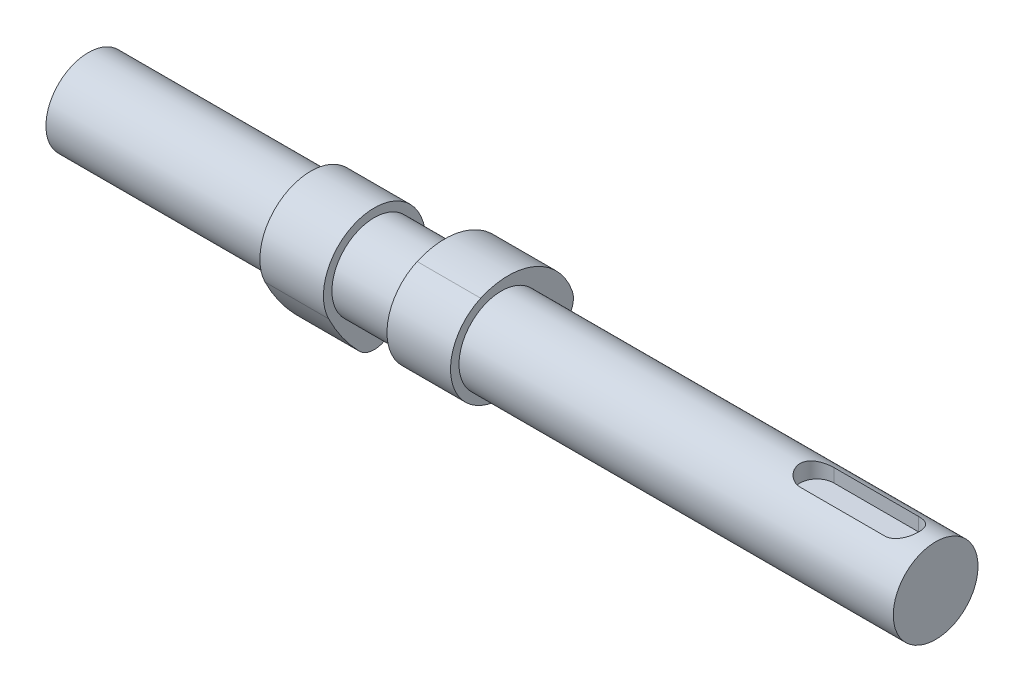
ISO-10303-21;
HEADER;
FILE_DESCRIPTION(('STEP AP214'),'2;1');
FILE_NAME('part.step','',(''),(''),'','','');
FILE_SCHEMA(('AUTOMOTIVE_DESIGN { 1 0 10303 214 1 1 1 1 }'));
ENDSEC;
DATA;
#1=APPLICATION_CONTEXT('core data for automotive mechanical design processes');
#2=APPLICATION_PROTOCOL_DEFINITION('international standard','automotive_design',2000,#1);
#3=PRODUCT_CONTEXT('',#1,'mechanical');
#4=PRODUCT('Part','Part','',(#3));
#5=PRODUCT_RELATED_PRODUCT_CATEGORY('part','',(#4));
#6=PRODUCT_DEFINITION_FORMATION('','',#4);
#7=PRODUCT_DEFINITION_CONTEXT('part definition',#1,'design');
#8=PRODUCT_DEFINITION('design','',#6,#7);
#9=PRODUCT_DEFINITION_SHAPE('','',#8);
#10=(LENGTH_UNIT() NAMED_UNIT(*) SI_UNIT(.MILLI.,.METRE.));
#11=(NAMED_UNIT(*) PLANE_ANGLE_UNIT() SI_UNIT($,.RADIAN.));
#12=(NAMED_UNIT(*) SI_UNIT($,.STERADIAN.) SOLID_ANGLE_UNIT());
#13=UNCERTAINTY_MEASURE_WITH_UNIT(LENGTH_MEASURE(1.E-05),#10,'distance_accuracy_value','');
#14=(GEOMETRIC_REPRESENTATION_CONTEXT(3) GLOBAL_UNCERTAINTY_ASSIGNED_CONTEXT((#13)) GLOBAL_UNIT_ASSIGNED_CONTEXT((#10,
#11,#12)) REPRESENTATION_CONTEXT('',''));
#15=CARTESIAN_POINT('',(0.,0.,0.));
#16=DIRECTION('',(0.,0.,1.));
#17=DIRECTION('',(1.,0.,0.));
#18=AXIS2_PLACEMENT_3D('',#15,#16,#17);
#19=CARTESIAN_POINT('',(-22.5,12.3749999999999,-25.1169141217627));
#20=DIRECTION('',(1.,0.,0.));
#21=DIRECTION('',(0.,1.,0.));
#22=AXIS2_PLACEMENT_3D('',#19,#20,#21);
#23=CYLINDRICAL_SURFACE('',#22,40.);
#24=CARTESIAN_POINT('',(-7.5,12.3749999999999,-25.1169141217627));
#25=DIRECTION('',(1.,0.,0.));
#26=DIRECTION('',(0.,-1.,0.));
#27=AXIS2_PLACEMENT_3D('',#24,#25,#26);
#28=CIRCLE('',#27,40.);
#29=CARTESIAN_POINT('',(-7.5,-5.30357142857138,10.7643917664697));
#30=VERTEX_POINT('',#29);
#31=CARTESIAN_POINT('',(-7.5,-15.4821428571428,3.58813058882329));
#32=VERTEX_POINT('',#31);
#33=EDGE_CURVE('E111',#30,#32,#28,.T.);
#34=ORIENTED_EDGE('',*,*,#33,.F.);
#35=DIRECTION('',(1.,0.,0.));
#36=VECTOR('',#35,1.);
#37=CARTESIAN_POINT('',(-22.5,-5.30357142857138,10.7643917664697));
#38=LINE('',#37,#36);
#39=CARTESIAN_POINT('',(-22.5,-5.30357142857138,10.7643917664697));
#40=VERTEX_POINT('',#39);
#41=EDGE_CURVE('E110',#40,#30,#38,.T.);
#42=ORIENTED_EDGE('',*,*,#41,.F.);
#43=CARTESIAN_POINT('',(-22.5,12.3749999999999,-25.1169141217627));
#44=DIRECTION('',(1.,0.,0.));
#45=DIRECTION('',(0.,-1.,0.));
#46=AXIS2_PLACEMENT_3D('',#43,#44,#45);
#47=CIRCLE('',#46,40.);
#48=CARTESIAN_POINT('',(-22.5,-15.4821428571428,3.58813058882329));
#49=VERTEX_POINT('',#48);
#50=EDGE_CURVE('E105',#40,#49,#47,.T.);
#51=ORIENTED_EDGE('',*,*,#50,.T.);
#52=DIRECTION('',(1.,0.,0.));
#53=VECTOR('',#52,1.);
#54=CARTESIAN_POINT('',(-22.5,-15.4821428571428,3.58813058882329));
#55=LINE('',#54,#53);
#56=EDGE_CURVE('E12',#49,#32,#55,.T.);
#57=ORIENTED_EDGE('',*,*,#56,.T.);
#58=EDGE_LOOP('',(#34,#42,#51,#57));
#59=FACE_BOUND('',#58,.T.);
#60=ADVANCED_FACE('F48',(#59),#23,.T.);
#61=CARTESIAN_POINT('',(-22.5,-12.,0.));
#62=DIRECTION('',(1.,0.,0.));
#63=DIRECTION('',(0.,1.,0.));
#64=AXIS2_PLACEMENT_3D('',#61,#62,#63);
#65=CYLINDRICAL_SURFACE('',#64,5.);
#66=CARTESIAN_POINT('',(-7.5,-12.,0.));
#67=DIRECTION('',(1.,0.,0.));
#68=DIRECTION('',(0.,-1.,0.));
#69=AXIS2_PLACEMENT_3D('',#66,#67,#68);
#70=CIRCLE('',#69,5.);
#71=CARTESIAN_POINT('',(-7.5,-16.7159090909091,-1.66138539968329));
#72=VERTEX_POINT('',#71);
#73=EDGE_CURVE('E113',#32,#72,#70,.T.);
#74=ORIENTED_EDGE('',*,*,#73,.F.);
#75=ORIENTED_EDGE('',*,*,#56,.F.);
#76=CARTESIAN_POINT('',(-22.5,-12.,0.));
#77=DIRECTION('',(1.,0.,0.));
#78=DIRECTION('',(0.,-1.,0.));
#79=AXIS2_PLACEMENT_3D('',#76,#77,#78);
#80=CIRCLE('',#79,5.);
#81=CARTESIAN_POINT('',(-22.5,-16.7159090909091,-1.66138539968329));
#82=VERTEX_POINT('',#81);
#83=EDGE_CURVE('E89',#49,#82,#80,.T.);
#84=ORIENTED_EDGE('',*,*,#83,.T.);
#85=DIRECTION('',(1.,0.,0.));
#86=VECTOR('',#85,1.);
#87=CARTESIAN_POINT('',(-22.5,-16.7159090909091,-1.66138539968329));
#88=LINE('',#87,#86);
#89=EDGE_CURVE('E56',#82,#72,#88,.T.);
#90=ORIENTED_EDGE('',*,*,#89,.T.);
#91=EDGE_LOOP('',(#74,#75,#84,#90));
#92=FACE_BOUND('',#91,.T.);
#93=ADVANCED_FACE('F103',(#92),#65,.T.);
#94=CARTESIAN_POINT('',(-22.5,-1.62499999999999,3.65504787930337));
#95=DIRECTION('',(1.,0.,0.));
#96=DIRECTION('',(0.,1.,0.));
#97=AXIS2_PLACEMENT_3D('',#94,#95,#96);
#98=CYLINDRICAL_SURFACE('',#97,16.);
#99=CARTESIAN_POINT('',(-7.5,-1.62499999999999,3.65504787930337));
#100=DIRECTION('',(1.,0.,0.));
#101=DIRECTION('',(0.,1.,0.));
#102=AXIS2_PLACEMENT_3D('',#99,#100,#101);
#103=CIRCLE('',#102,16.);
#104=CARTESIAN_POINT('',(-7.5,4.87499999999996,-10.9651436379101));
#105=VERTEX_POINT('',#104);
#106=EDGE_CURVE('E99',#72,#105,#103,.T.);
#107=ORIENTED_EDGE('',*,*,#106,.F.);
#108=ORIENTED_EDGE('',*,*,#89,.F.);
#109=CARTESIAN_POINT('',(-22.5,-1.62499999999999,3.65504787930337));
#110=DIRECTION('',(1.,0.,0.));
#111=DIRECTION('',(0.,1.,0.));
#112=AXIS2_PLACEMENT_3D('',#109,#110,#111);
#113=CIRCLE('',#112,16.);
#114=CARTESIAN_POINT('',(-22.5,4.87499999999996,-10.9651436379101));
#115=VERTEX_POINT('',#114);
#116=EDGE_CURVE('E92',#82,#115,#113,.T.);
#117=ORIENTED_EDGE('',*,*,#116,.T.);
#118=DIRECTION('',(1.,0.,0.));
#119=VECTOR('',#118,1.);
#120=CARTESIAN_POINT('',(-22.5,4.87499999999996,-10.9651436379101));
#121=LINE('',#120,#119);
#122=EDGE_CURVE('E102',#115,#105,#121,.T.);
#123=ORIENTED_EDGE('',*,*,#122,.T.);
#124=EDGE_LOOP('',(#107,#108,#117,#123));
#125=FACE_BOUND('',#124,.T.);
#126=ADVANCED_FACE('F98',(#125),#98,.T.);
#127=CARTESIAN_POINT('',(-22.5,0.,0.));
#128=DIRECTION('',(1.,0.,0.));
#129=DIRECTION('',(0.,1.,0.));
#130=AXIS2_PLACEMENT_3D('',#127,#128,#129);
#131=CYLINDRICAL_SURFACE('',#130,12.);
#132=CARTESIAN_POINT('',(-7.5,0.,0.));
#133=DIRECTION('',(1.,0.,0.));
#134=DIRECTION('',(0.,-1.,0.));
#135=AXIS2_PLACEMENT_3D('',#132,#133,#134);
#136=CIRCLE('',#135,12.);
#137=EDGE_CURVE('E78',#105,#30,#136,.T.);
#138=ORIENTED_EDGE('',*,*,#137,.F.);
#139=ORIENTED_EDGE('',*,*,#122,.F.);
#140=CARTESIAN_POINT('',(-22.5,0.,0.));
#141=DIRECTION('',(1.,0.,0.));
#142=DIRECTION('',(0.,-1.,0.));
#143=AXIS2_PLACEMENT_3D('',#140,#141,#142);
#144=CIRCLE('',#143,12.);
#145=EDGE_CURVE('E64',#115,#40,#144,.T.);
#146=ORIENTED_EDGE('',*,*,#145,.T.);
#147=ORIENTED_EDGE('',*,*,#41,.T.);
#148=EDGE_LOOP('',(#138,#139,#146,#147));
#149=FACE_BOUND('',#148,.T.);
#150=ADVANCED_FACE('F122',(#149),#131,.T.);
#151=CARTESIAN_POINT('',(-22.5,0.187499999999956,-12.5584570608813));
#152=DIRECTION('',(-1.,0.,0.));
#153=DIRECTION('',(0.,-1.,0.));
#154=AXIS2_PLACEMENT_3D('',#151,#152,#153);
#155=PLANE('',#154);
#156=ORIENTED_EDGE('',*,*,#50,.F.);
#157=ORIENTED_EDGE('',*,*,#145,.F.);
#158=ORIENTED_EDGE('',*,*,#116,.F.);
#159=ORIENTED_EDGE('',*,*,#83,.F.);
#160=EDGE_LOOP('',(#156,#157,#158,#159));
#161=FACE_BOUND('',#160,.T.);
#162=ADVANCED_FACE('F94',(#161),#155,.T.);
#163=CARTESIAN_POINT('',(-7.5,0.187499999999956,-12.5584570608813));
#164=DIRECTION('',(-1.,0.,0.));
#165=DIRECTION('',(0.,-1.,0.));
#166=AXIS2_PLACEMENT_3D('',#163,#164,#165);
#167=PLANE('',#166);
#168=ORIENTED_EDGE('',*,*,#33,.T.);
#169=ORIENTED_EDGE('',*,*,#73,.T.);
#170=ORIENTED_EDGE('',*,*,#106,.T.);
#171=ORIENTED_EDGE('',*,*,#137,.T.);
#172=EDGE_LOOP('',(#168,#169,#170,#171));
#173=FACE_BOUND('',#172,.T.);
#174=ADVANCED_FACE('F118',(#173),#167,.F.);
#175=CLOSED_SHELL('',(#60,#93,#126,#150,#162,#174));
#176=MANIFOLD_SOLID_BREP('B2',#175);
#177=CARTESIAN_POINT('',(22.5,25.1169141217626,12.375));
#178=DIRECTION('',(-1.,0.,0.));
#179=DIRECTION('',(0.,0.,1.));
#180=AXIS2_PLACEMENT_3D('',#177,#178,#179);
#181=CYLINDRICAL_SURFACE('',#180,40.);
#182=CARTESIAN_POINT('',(7.5,25.1169141217626,12.375));
#183=DIRECTION('',(1.,0.,0.));
#184=DIRECTION('',(0.,0.,-1.));
#185=AXIS2_PLACEMENT_3D('',#182,#183,#184);
#186=CIRCLE('',#185,40.);
#187=CARTESIAN_POINT('',(7.5,-10.7643917664697,-5.30357142857142));
#188=VERTEX_POINT('',#187);
#189=CARTESIAN_POINT('',(7.5,-3.58813058882324,-15.4821428571429));
#190=VERTEX_POINT('',#189);
#191=EDGE_CURVE('E256',#188,#190,#186,.T.);
#192=ORIENTED_EDGE('',*,*,#191,.T.);
#193=DIRECTION('',(-1.,0.,0.));
#194=VECTOR('',#193,1.);
#195=CARTESIAN_POINT('',(22.5,-3.58813058882324,-15.4821428571429));
#196=LINE('',#195,#194);
#197=CARTESIAN_POINT('',(22.5,-3.58813058882324,-15.4821428571429));
#198=VERTEX_POINT('',#197);
#199=EDGE_CURVE('E46',#198,#190,#196,.T.);
#200=ORIENTED_EDGE('',*,*,#199,.F.);
#201=CARTESIAN_POINT('',(22.5,25.1169141217626,12.375));
#202=DIRECTION('',(1.,0.,0.));
#203=DIRECTION('',(0.,0.,-1.));
#204=AXIS2_PLACEMENT_3D('',#201,#202,#203);
#205=CIRCLE('',#204,40.);
#206=CARTESIAN_POINT('',(22.5,-10.7643917664697,-5.30357142857142));
#207=VERTEX_POINT('',#206);
#208=EDGE_CURVE('E244',#207,#198,#205,.T.);
#209=ORIENTED_EDGE('',*,*,#208,.F.);
#210=DIRECTION('',(-1.,0.,0.));
#211=VECTOR('',#210,1.);
#212=CARTESIAN_POINT('',(22.5,-10.7643917664697,-5.30357142857142));
#213=LINE('',#212,#211);
#214=EDGE_CURVE('E252',#207,#188,#213,.T.);
#215=ORIENTED_EDGE('',*,*,#214,.T.);
#216=EDGE_LOOP('',(#192,#200,#209,#215));
#217=FACE_BOUND('',#216,.T.);
#218=ADVANCED_FACE('F193',(#217),#181,.T.);
#219=CARTESIAN_POINT('',(22.5,0.,-12.));
#220=DIRECTION('',(-1.,0.,0.));
#221=DIRECTION('',(0.,0.,1.));
#222=AXIS2_PLACEMENT_3D('',#219,#220,#221);
#223=CYLINDRICAL_SURFACE('',#222,5.);
#224=CARTESIAN_POINT('',(7.5,0.,-12.));
#225=DIRECTION('',(1.,0.,0.));
#226=DIRECTION('',(0.,0.,-1.));
#227=AXIS2_PLACEMENT_3D('',#224,#225,#226);
#228=CIRCLE('',#227,5.);
#229=CARTESIAN_POINT('',(7.5,1.66138539968335,-16.7159090909091));
#230=VERTEX_POINT('',#229);
#231=EDGE_CURVE('E248',#190,#230,#228,.T.);
#232=ORIENTED_EDGE('',*,*,#231,.T.);
#233=DIRECTION('',(-1.,0.,0.));
#234=VECTOR('',#233,1.);
#235=CARTESIAN_POINT('',(22.5,1.66138539968335,-16.7159090909091));
#236=LINE('',#235,#234);
#237=CARTESIAN_POINT('',(22.5,1.66138539968335,-16.7159090909091));
#238=VERTEX_POINT('',#237);
#239=EDGE_CURVE('E201',#238,#230,#236,.T.);
#240=ORIENTED_EDGE('',*,*,#239,.F.);
#241=CARTESIAN_POINT('',(22.5,0.,-12.));
#242=DIRECTION('',(1.,0.,0.));
#243=DIRECTION('',(0.,0.,-1.));
#244=AXIS2_PLACEMENT_3D('',#241,#242,#243);
#245=CIRCLE('',#244,5.);
#246=EDGE_CURVE('E239',#198,#238,#245,.T.);
#247=ORIENTED_EDGE('',*,*,#246,.F.);
#248=ORIENTED_EDGE('',*,*,#199,.T.);
#249=EDGE_LOOP('',(#232,#240,#247,#248));
#250=FACE_BOUND('',#249,.T.);
#251=ADVANCED_FACE('F247',(#250),#223,.T.);
#252=CARTESIAN_POINT('',(22.5,-3.65504787930336,-1.625));
#253=DIRECTION('',(-1.,0.,0.));
#254=DIRECTION('',(0.,0.,1.));
#255=AXIS2_PLACEMENT_3D('',#252,#253,#254);
#256=CYLINDRICAL_SURFACE('',#255,16.);
#257=CARTESIAN_POINT('',(7.5,-3.65504787930336,-1.625));
#258=DIRECTION('',(1.,0.,0.));
#259=DIRECTION('',(0.,0.,1.));
#260=AXIS2_PLACEMENT_3D('',#257,#258,#259);
#261=CIRCLE('',#260,16.);
#262=CARTESIAN_POINT('',(7.5,10.9651436379101,4.875));
#263=VERTEX_POINT('',#262);
#264=EDGE_CURVE('E226',#230,#263,#261,.T.);
#265=ORIENTED_EDGE('',*,*,#264,.T.);
#266=DIRECTION('',(-1.,0.,0.));
#267=VECTOR('',#266,1.);
#268=CARTESIAN_POINT('',(22.5,10.9651436379101,4.875));
#269=LINE('',#268,#267);
#270=CARTESIAN_POINT('',(22.5,10.9651436379101,4.875));
#271=VERTEX_POINT('',#270);
#272=EDGE_CURVE('E249',#271,#263,#269,.T.);
#273=ORIENTED_EDGE('',*,*,#272,.F.);
#274=CARTESIAN_POINT('',(22.5,-3.65504787930336,-1.625));
#275=DIRECTION('',(1.,0.,0.));
#276=DIRECTION('',(0.,0.,1.));
#277=AXIS2_PLACEMENT_3D('',#274,#275,#276);
#278=CIRCLE('',#277,16.);
#279=EDGE_CURVE('E242',#238,#271,#278,.T.);
#280=ORIENTED_EDGE('',*,*,#279,.F.);
#281=ORIENTED_EDGE('',*,*,#239,.T.);
#282=EDGE_LOOP('',(#265,#273,#280,#281));
#283=FACE_BOUND('',#282,.T.);
#284=ADVANCED_FACE('F250',(#283),#256,.T.);
#285=CARTESIAN_POINT('',(22.5,0.,0.));
#286=DIRECTION('',(-1.,0.,0.));
#287=DIRECTION('',(0.,0.,1.));
#288=AXIS2_PLACEMENT_3D('',#285,#286,#287);
#289=CYLINDRICAL_SURFACE('',#288,12.);
#290=CARTESIAN_POINT('',(7.5,0.,0.));
#291=DIRECTION('',(1.,0.,0.));
#292=DIRECTION('',(0.,0.,-1.));
#293=AXIS2_PLACEMENT_3D('',#290,#291,#292);
#294=CIRCLE('',#293,12.);
#295=EDGE_CURVE('E232',#263,#188,#294,.T.);
#296=ORIENTED_EDGE('',*,*,#295,.T.);
#297=ORIENTED_EDGE('',*,*,#214,.F.);
#298=CARTESIAN_POINT('',(22.5,0.,0.));
#299=DIRECTION('',(1.,0.,0.));
#300=DIRECTION('',(0.,0.,-1.));
#301=AXIS2_PLACEMENT_3D('',#298,#299,#300);
#302=CIRCLE('',#301,12.);
#303=EDGE_CURVE('E209',#271,#207,#302,.T.);
#304=ORIENTED_EDGE('',*,*,#303,.F.);
#305=ORIENTED_EDGE('',*,*,#272,.T.);
#306=EDGE_LOOP('',(#296,#297,#304,#305));
#307=FACE_BOUND('',#306,.T.);
#308=ADVANCED_FACE('F263',(#307),#289,.T.);
#309=CARTESIAN_POINT('',(22.5,12.5584570608813,0.1875));
#310=DIRECTION('',(1.,0.,0.));
#311=DIRECTION('',(0.,0.,-1.));
#312=AXIS2_PLACEMENT_3D('',#309,#310,#311);
#313=PLANE('',#312);
#314=ORIENTED_EDGE('',*,*,#208,.T.);
#315=ORIENTED_EDGE('',*,*,#246,.T.);
#316=ORIENTED_EDGE('',*,*,#279,.T.);
#317=ORIENTED_EDGE('',*,*,#303,.T.);
#318=EDGE_LOOP('',(#314,#315,#316,#317));
#319=FACE_BOUND('',#318,.T.);
#320=ADVANCED_FACE('F240',(#319),#313,.T.);
#321=CARTESIAN_POINT('',(7.5,12.5584570608813,0.1875));
#322=DIRECTION('',(1.,0.,0.));
#323=DIRECTION('',(0.,0.,-1.));
#324=AXIS2_PLACEMENT_3D('',#321,#322,#323);
#325=PLANE('',#324);
#326=ORIENTED_EDGE('',*,*,#191,.F.);
#327=ORIENTED_EDGE('',*,*,#295,.F.);
#328=ORIENTED_EDGE('',*,*,#264,.F.);
#329=ORIENTED_EDGE('',*,*,#231,.F.);
#330=EDGE_LOOP('',(#326,#327,#328,#329));
#331=FACE_BOUND('',#330,.T.);
#332=ADVANCED_FACE('F266',(#331),#325,.F.);
#333=CLOSED_SHELL('',(#218,#251,#284,#308,#320,#332));
#334=MANIFOLD_SOLID_BREP('B6',#333);
#335=CARTESIAN_POINT('',(125.,0.,0.));
#336=DIRECTION('',(-1.,0.,0.));
#337=DIRECTION('',(0.,0.,1.));
#338=AXIS2_PLACEMENT_3D('',#335,#336,#337);
#339=CYLINDRICAL_SURFACE('',#338,10.);
#340=DIRECTION('',(-1.,0.,0.));
#341=VECTOR('',#340,1.);
#342=CARTESIAN_POINT('',(125.,9.16515138991168,4.));
#343=LINE('',#342,#341);
#344=CARTESIAN_POINT('',(117.,9.16515138991168,4.));
#345=VERTEX_POINT('',#344);
#346=CARTESIAN_POINT('',(97.,9.16515138991168,4.));
#347=VERTEX_POINT('',#346);
#348=EDGE_CURVE('E191',#345,#347,#343,.T.);
#349=ORIENTED_EDGE('',*,*,#348,.T.);
#350=CARTESIAN_POINT('',(97.,9.16515138991168,4.));
#351=CARTESIAN_POINT('',(96.8923882949458,9.16512928809544,4.00001596071938));
#352=CARTESIAN_POINT('',(96.7847886688333,9.16704612011429,3.99565782731266));
#353=CARTESIAN_POINT('',(96.5704574034612,9.17459250745478,3.9783181194646));
#354=CARTESIAN_POINT('',(96.4637254492831,9.18022064873058,3.96533982937531));
#355=CARTESIAN_POINT('',(96.2523063568937,9.19499565865171,3.93095207352899));
#356=CARTESIAN_POINT('',(96.1476128319149,9.20412861441611,3.90957593640916));
#357=CARTESIAN_POINT('',(95.9405984565681,9.22560106586818,3.85863260381273));
#358=CARTESIAN_POINT('',(95.8382777514449,9.23794075728508,3.82906490834148));
#359=CARTESIAN_POINT('',(95.5361282988375,9.2791858250141,3.72853943587112));
#360=CARTESIAN_POINT('',(95.3406915386172,9.3123489831615,3.64568978920222));
#361=CARTESIAN_POINT('',(94.9664088398381,9.38624741529469,3.45096383184148));
#362=CARTESIAN_POINT('',(94.7875788940914,9.42698987727425,3.33905992673095));
#363=CARTESIAN_POINT('',(94.4414752066361,9.51401998804847,3.08263671474507));
#364=CARTESIAN_POINT('',(94.2752655660996,9.56048491272144,2.93673827988501));
#365=CARTESIAN_POINT('',(93.9689194556385,9.65225581096199,2.61939292349378));
#366=CARTESIAN_POINT('',(93.8287883384928,9.69756154495612,2.44794076987998));
#367=CARTESIAN_POINT('',(93.5731872113755,9.78406834216145,2.07601181629753));
#368=CARTESIAN_POINT('',(93.4589103805898,9.82503649102096,1.87465586655103));
#369=CARTESIAN_POINT('',(93.2663118555086,9.89607888234979,1.45364828604453));
#370=CARTESIAN_POINT('',(93.1879751552067,9.92615767032247,1.23400433637532));
#371=CARTESIAN_POINT('',(93.0733175942291,9.97076629361036,0.793934884187379));
#372=CARTESIAN_POINT('',(93.0351460866969,9.98597845290694,0.574062114869031));
#373=CARTESIAN_POINT('',(92.9959430515965,10.001606202074,0.130536855092214));
#374=CARTESIAN_POINT('',(92.9948983667482,10.0020270338048,-0.0931142682526694));
#375=CARTESIAN_POINT('',(93.0289656379282,9.98843920775428,-0.524466731987224));
#376=CARTESIAN_POINT('',(93.0620499465532,9.97523973659777,-0.732358330632746));
#377=CARTESIAN_POINT('',(93.1599870009102,9.93698538393897,-1.13934964738688));
#378=CARTESIAN_POINT('',(93.2248415445704,9.91192983148495,-1.33844886722558));
#379=CARTESIAN_POINT('',(93.3852720377719,9.85193670608706,-1.72579479688348));
#380=CARTESIAN_POINT('',(93.481296395839,9.81685584875391,-1.91383264586891));
#381=CARTESIAN_POINT('',(93.7009312637048,9.74029168639969,-2.2716159956307));
#382=CARTESIAN_POINT('',(93.8245514514378,9.69880613681324,-2.44135504792269));
#383=CARTESIAN_POINT('',(94.1052800574364,9.61043706268122,-2.7695225783069));
#384=CARTESIAN_POINT('',(94.2640530171164,9.56337795745419,-2.92647922614483));
#385=CARTESIAN_POINT('',(94.6059921366628,9.47123359153046,-3.2122147086262));
#386=CARTESIAN_POINT('',(94.7891693487996,9.42614923753061,-3.34098070594789));
#387=CARTESIAN_POINT('',(95.0816356456234,9.36326134539255,-3.51186134851388));
#388=CARTESIAN_POINT('',(95.1836718383149,9.34283170142195,-3.56571263251515));
#389=CARTESIAN_POINT('',(95.3923923024092,9.30450957703985,-3.66454761505659));
#390=CARTESIAN_POINT('',(95.4990745457273,9.28661600381593,-3.70953513634086));
#391=CARTESIAN_POINT('',(95.7162289304962,9.25400250539921,-3.79016254319007));
#392=CARTESIAN_POINT('',(95.8266961700413,9.23927864276951,-3.82581403809398));
#393=CARTESIAN_POINT('',(96.0506683681487,9.2135146773091,-3.88744848158463));
#394=CARTESIAN_POINT('',(96.1641719402125,9.20247292309662,-3.91343576505911));
#395=CARTESIAN_POINT('',(96.3974454473375,9.18417798205495,-3.95619393609845));
#396=CARTESIAN_POINT('',(96.5172941945638,9.17707470750587,-3.97260125584169));
#397=CARTESIAN_POINT('',(96.758090929137,9.16754485606458,-3.99451448409732));
#398=CARTESIAN_POINT('',(96.8790381929227,9.16511539745838,-4.0000271099601));
#399=CARTESIAN_POINT('',(97.,9.16515138991168,-4.));
#400=B_SPLINE_CURVE_WITH_KNOTS('',3,(#350,#351,#352,#353,#354,#355,#356,#357,#358,#359,#360,
#361,#362,#363,#364,#365,#366,#367,#368,#369,#370,#371,#372,#373,#374,#375,#376,#377,#378,#379,
#380,#381,#382,#383,#384,#385,#386,#387,#388,#389,#390,#391,#392,#393,#394,#395,#396,#397,#398,
#399),.UNSPECIFIED.,.F.,.F.,(4,2,2,2,2,2,2,2,2,2,2,2,2,2,2,2,2,2,2,2,2,2,2,2,4),(0.,
0.322709706217834,0.645296527806424,0.966615822543774,1.28795473422461,1.92936600351818,
2.5713886988925,3.24636095994996,3.92147161082383,4.62325717855527,5.32474946398645,
5.99227753012539,6.65956903033311,7.2893783052307,7.91922322615308,8.55856353859093,
9.19812842270037,9.87963749353246,10.5614562641081,10.9125878460839,11.2635676597187,
11.6141089352909,11.964492785171,12.3274303244848,12.6901440171997),.UNSPECIFIED.);
#401=CARTESIAN_POINT('',(97.,9.16515138991168,-4.));
#402=VERTEX_POINT('',#401);
#403=EDGE_CURVE('E404',#347,#402,#400,.T.);
#404=ORIENTED_EDGE('',*,*,#403,.T.);
#405=DIRECTION('',(-1.,0.,0.));
#406=VECTOR('',#405,1.);
#407=CARTESIAN_POINT('',(125.,9.16515138991168,-4.));
#408=LINE('',#407,#406);
#409=CARTESIAN_POINT('',(117.,9.16515138991168,-4.));
#410=VERTEX_POINT('',#409);
#411=EDGE_CURVE('E337',#402,#410,#408,.F.);
#412=ORIENTED_EDGE('',*,*,#411,.T.);
#413=CARTESIAN_POINT('',(117.,9.16515138991168,-4.));
#414=CARTESIAN_POINT('',(117.107611705054,9.16512928809544,-4.00001596071937));
#415=CARTESIAN_POINT('',(117.215211331167,9.16704612011429,-3.99565782731265));
#416=CARTESIAN_POINT('',(117.429542596539,9.17459250745478,-3.97831811946459));
#417=CARTESIAN_POINT('',(117.536274550717,9.18022064873058,-3.96533982937531));
#418=CARTESIAN_POINT('',(117.747693643106,9.19499565865171,-3.93095207352899));
#419=CARTESIAN_POINT('',(117.852387168085,9.20412861441611,-3.90957593640916));
#420=CARTESIAN_POINT('',(118.059401543432,9.22560106586818,-3.85863260381273));
#421=CARTESIAN_POINT('',(118.161722248555,9.23794075728508,-3.82906490834148));
#422=CARTESIAN_POINT('',(118.463871701162,9.2791858250141,-3.72853943587112));
#423=CARTESIAN_POINT('',(118.659308461383,9.3123489831615,-3.64568978920222));
#424=CARTESIAN_POINT('',(119.033591160162,9.38624741529469,-3.45096383184147));
#425=CARTESIAN_POINT('',(119.212421105909,9.42698987727425,-3.33905992673094));
#426=CARTESIAN_POINT('',(119.558524793364,9.51401998804847,-3.08263671474506));
#427=CARTESIAN_POINT('',(119.7247344339,9.56048491272144,-2.93673827988501));
#428=CARTESIAN_POINT('',(120.031080544362,9.65225581096199,-2.61939292349378));
#429=CARTESIAN_POINT('',(120.171211661507,9.69756154495612,-2.44794076987998));
#430=CARTESIAN_POINT('',(120.426812788624,9.78406834216145,-2.07601181629754));
#431=CARTESIAN_POINT('',(120.54108961941,9.82503649102096,-1.87465586655103));
#432=CARTESIAN_POINT('',(120.733688144491,9.89607888234979,-1.45364828604453));
#433=CARTESIAN_POINT('',(120.812024844793,9.92615767032247,-1.23400433637531));
#434=CARTESIAN_POINT('',(120.926682405771,9.97076629361036,-0.793934884187374));
#435=CARTESIAN_POINT('',(120.964853913303,9.98597845290694,-0.574062114869026));
#436=CARTESIAN_POINT('',(121.004056948403,10.001606202074,-0.130536855092209));
#437=CARTESIAN_POINT('',(121.005101633252,10.0020270338048,0.0931142682526744));
#438=CARTESIAN_POINT('',(120.971034362072,9.98843920775428,0.52446673198723));
#439=CARTESIAN_POINT('',(120.937950053447,9.97523973659777,0.732358330632752));
#440=CARTESIAN_POINT('',(120.84001299909,9.93698538393897,1.13934964738688));
#441=CARTESIAN_POINT('',(120.77515845543,9.91192983148495,1.33844886722558));
#442=CARTESIAN_POINT('',(120.614727962228,9.85193670608706,1.72579479688349));
#443=CARTESIAN_POINT('',(120.518703604161,9.81685584875391,1.91383264586892));
#444=CARTESIAN_POINT('',(120.299068736295,9.74029168639969,2.27161599563071));
#445=CARTESIAN_POINT('',(120.175448548562,9.69880613681324,2.4413550479227));
#446=CARTESIAN_POINT('',(119.894719942564,9.61043706268122,2.7695225783069));
#447=CARTESIAN_POINT('',(119.735946982884,9.56337795745419,2.92647922614483));
#448=CARTESIAN_POINT('',(119.394007863337,9.47123359153046,3.2122147086262));
#449=CARTESIAN_POINT('',(119.2108306512,9.42614923753061,3.34098070594789));
#450=CARTESIAN_POINT('',(118.918364354377,9.36326134539254,3.51186134851389));
#451=CARTESIAN_POINT('',(118.816328161685,9.34283170142194,3.56571263251515));
#452=CARTESIAN_POINT('',(118.607607697591,9.30450957703985,3.66454761505659));
#453=CARTESIAN_POINT('',(118.500925454273,9.28661600381593,3.70953513634086));
#454=CARTESIAN_POINT('',(118.283771069504,9.25400250539921,3.79016254319007));
#455=CARTESIAN_POINT('',(118.173303829959,9.23927864276951,3.82581403809398));
#456=CARTESIAN_POINT('',(117.949331631851,9.2135146773091,3.88744848158463));
#457=CARTESIAN_POINT('',(117.835828059787,9.20247292309662,3.91343576505912));
#458=CARTESIAN_POINT('',(117.602554552662,9.18417798205495,3.95619393609845));
#459=CARTESIAN_POINT('',(117.482705805436,9.17707470750587,3.9726012558417));
#460=CARTESIAN_POINT('',(117.241909070863,9.16754485606458,3.99451448409732));
#461=CARTESIAN_POINT('',(117.120961807077,9.16511539745838,4.0000271099601));
#462=CARTESIAN_POINT('',(117.,9.16515138991168,4.));
#463=B_SPLINE_CURVE_WITH_KNOTS('',3,(#413,#414,#415,#416,#417,#418,#419,#420,#421,#422,#423,
#424,#425,#426,#427,#428,#429,#430,#431,#432,#433,#434,#435,#436,#437,#438,#439,#440,#441,#442,
#443,#444,#445,#446,#447,#448,#449,#450,#451,#452,#453,#454,#455,#456,#457,#458,#459,#460,#461,
#462),.UNSPECIFIED.,.F.,.F.,(4,2,2,2,2,2,2,2,2,2,2,2,2,2,2,2,2,2,2,2,2,2,2,2,4),(0.,
0.322709706217834,0.645296527806424,0.966615822543774,1.28795473422461,1.92936600351818,
2.5713886988925,3.24636095994996,3.92147161082381,4.62325717855526,5.32474946398644,
5.99227753012539,6.65956903033311,7.2893783052307,7.91922322615308,8.55856353859093,
9.19812842270038,9.87963749353244,10.5614562641081,10.9125878460839,11.2635676597187,
11.6141089352909,11.964492785171,12.3274303244848,12.6901440171997),.UNSPECIFIED.);
#464=EDGE_CURVE('E344',#410,#345,#463,.T.);
#465=ORIENTED_EDGE('',*,*,#464,.T.);
#466=EDGE_LOOP('',(#349,#404,#412,#465));
#467=FACE_BOUND('',#466,.T.);
#468=CARTESIAN_POINT('',(125.,0.,0.));
#469=DIRECTION('',(1.,0.,0.));
#470=DIRECTION('',(0.,0.,-1.));
#471=AXIS2_PLACEMENT_3D('',#468,#469,#470);
#472=CIRCLE('',#471,10.);
#473=CARTESIAN_POINT('',(125.,0.,-10.));
#474=VERTEX_POINT('',#473);
#475=EDGE_CURVE('E401',#474,#474,#472,.T.);
#476=ORIENTED_EDGE('',*,*,#475,.F.);
#477=EDGE_LOOP('',(#476));
#478=FACE_BOUND('',#477,.T.);
#479=CARTESIAN_POINT('',(-75.,0.,0.));
#480=DIRECTION('',(1.,0.,0.));
#481=DIRECTION('',(0.,0.,-1.));
#482=AXIS2_PLACEMENT_3D('',#479,#480,#481);
#483=CIRCLE('',#482,10.);
#484=CARTESIAN_POINT('',(-75.,0.,-10.));
#485=VERTEX_POINT('',#484);
#486=EDGE_CURVE('E395',#485,#485,#483,.T.);
#487=ORIENTED_EDGE('',*,*,#486,.T.);
#488=EDGE_LOOP('',(#487));
#489=FACE_BOUND('',#488,.T.);
#490=ADVANCED_FACE('F329',(#467,#478,#489),#339,.T.);
#491=CARTESIAN_POINT('',(125.,0.,0.));
#492=DIRECTION('',(1.,0.,0.));
#493=DIRECTION('',(0.,0.,-1.));
#494=AXIS2_PLACEMENT_3D('',#491,#492,#493);
#495=PLANE('',#494);
#496=ORIENTED_EDGE('',*,*,#475,.T.);
#497=EDGE_LOOP('',(#496));
#498=FACE_BOUND('',#497,.T.);
#499=ADVANCED_FACE('F431',(#498),#495,.T.);
#500=CARTESIAN_POINT('',(-75.,0.,0.));
#501=DIRECTION('',(1.,0.,0.));
#502=DIRECTION('',(0.,0.,-1.));
#503=AXIS2_PLACEMENT_3D('',#500,#501,#502);
#504=PLANE('',#503);
#505=ORIENTED_EDGE('',*,*,#486,.F.);
#506=EDGE_LOOP('',(#505));
#507=FACE_BOUND('',#506,.T.);
#508=ADVANCED_FACE('F429',(#507),#504,.F.);
#509=CARTESIAN_POINT('',(117.,6.,0.));
#510=DIRECTION('',(0.,1.,0.));
#511=DIRECTION('',(0.,0.,1.));
#512=AXIS2_PLACEMENT_3D('',#509,#510,#511);
#513=CYLINDRICAL_SURFACE('',#512,4.);
#514=DIRECTION('',(0.,1.,0.));
#515=VECTOR('',#514,1.);
#516=CARTESIAN_POINT('',(117.,6.,-4.));
#517=LINE('',#516,#515);
#518=CARTESIAN_POINT('',(117.,6.,-4.));
#519=VERTEX_POINT('',#518);
#520=EDGE_CURVE('E367',#519,#410,#517,.T.);
#521=ORIENTED_EDGE('',*,*,#520,.F.);
#522=CARTESIAN_POINT('',(117.,6.,0.));
#523=DIRECTION('',(0.,1.,0.));
#524=DIRECTION('',(0.,0.,1.));
#525=AXIS2_PLACEMENT_3D('',#522,#523,#524);
#526=CIRCLE('',#525,4.);
#527=CARTESIAN_POINT('',(117.,6.,4.));
#528=VERTEX_POINT('',#527);
#529=EDGE_CURVE('E371',#528,#519,#526,.T.);
#530=ORIENTED_EDGE('',*,*,#529,.F.);
#531=DIRECTION('',(0.,1.,0.));
#532=VECTOR('',#531,1.);
#533=CARTESIAN_POINT('',(117.,6.,4.));
#534=LINE('',#533,#532);
#535=EDGE_CURVE('E393',#528,#345,#534,.T.);
#536=ORIENTED_EDGE('',*,*,#535,.T.);
#537=ORIENTED_EDGE('',*,*,#464,.F.);
#538=EDGE_LOOP('',(#521,#530,#536,#537));
#539=FACE_BOUND('',#538,.T.);
#540=ADVANCED_FACE('F369',(#539),#513,.F.);
#541=CARTESIAN_POINT('',(117.,6.,4.));
#542=DIRECTION('',(0.,0.,1.));
#543=DIRECTION('',(1.,0.,0.));
#544=AXIS2_PLACEMENT_3D('',#541,#542,#543);
#545=PLANE('',#544);
#546=ORIENTED_EDGE('',*,*,#535,.F.);
#547=DIRECTION('',(1.,0.,0.));
#548=VECTOR('',#547,1.);
#549=CARTESIAN_POINT('',(117.,6.,4.));
#550=LINE('',#549,#548);
#551=CARTESIAN_POINT('',(97.,6.,4.));
#552=VERTEX_POINT('',#551);
#553=EDGE_CURVE('E376',#552,#528,#550,.T.);
#554=ORIENTED_EDGE('',*,*,#553,.F.);
#555=DIRECTION('',(0.,1.,0.));
#556=VECTOR('',#555,1.);
#557=CARTESIAN_POINT('',(97.,6.,4.));
#558=LINE('',#557,#556);
#559=EDGE_CURVE('E396',#552,#347,#558,.T.);
#560=ORIENTED_EDGE('',*,*,#559,.T.);
#561=ORIENTED_EDGE('',*,*,#348,.F.);
#562=EDGE_LOOP('',(#546,#554,#560,#561));
#563=FACE_BOUND('',#562,.T.);
#564=ADVANCED_FACE('F422',(#563),#545,.F.);
#565=CARTESIAN_POINT('',(97.,6.,0.));
#566=DIRECTION('',(0.,1.,0.));
#567=DIRECTION('',(0.,0.,1.));
#568=AXIS2_PLACEMENT_3D('',#565,#566,#567);
#569=CYLINDRICAL_SURFACE('',#568,4.);
#570=ORIENTED_EDGE('',*,*,#559,.F.);
#571=CARTESIAN_POINT('',(97.,6.,0.));
#572=DIRECTION('',(0.,1.,0.));
#573=DIRECTION('',(0.,0.,1.));
#574=AXIS2_PLACEMENT_3D('',#571,#572,#573);
#575=CIRCLE('',#574,4.);
#576=CARTESIAN_POINT('',(97.,6.,-4.));
#577=VERTEX_POINT('',#576);
#578=EDGE_CURVE('E385',#577,#552,#575,.T.);
#579=ORIENTED_EDGE('',*,*,#578,.F.);
#580=DIRECTION('',(0.,1.,0.));
#581=VECTOR('',#580,1.);
#582=CARTESIAN_POINT('',(97.,6.,-4.));
#583=LINE('',#582,#581);
#584=EDGE_CURVE('E375',#577,#402,#583,.T.);
#585=ORIENTED_EDGE('',*,*,#584,.T.);
#586=ORIENTED_EDGE('',*,*,#403,.F.);
#587=EDGE_LOOP('',(#570,#579,#585,#586));
#588=FACE_BOUND('',#587,.T.);
#589=ADVANCED_FACE('F417',(#588),#569,.F.);
#590=CARTESIAN_POINT('',(117.,6.,-4.));
#591=DIRECTION('',(0.,0.,-1.));
#592=DIRECTION('',(-1.,0.,0.));
#593=AXIS2_PLACEMENT_3D('',#590,#591,#592);
#594=PLANE('',#593);
#595=ORIENTED_EDGE('',*,*,#584,.F.);
#596=DIRECTION('',(-1.,0.,0.));
#597=VECTOR('',#596,1.);
#598=CARTESIAN_POINT('',(117.,6.,-4.));
#599=LINE('',#598,#597);
#600=EDGE_CURVE('E379',#519,#577,#599,.T.);
#601=ORIENTED_EDGE('',*,*,#600,.F.);
#602=ORIENTED_EDGE('',*,*,#520,.T.);
#603=ORIENTED_EDGE('',*,*,#411,.F.);
#604=EDGE_LOOP('',(#595,#601,#602,#603));
#605=FACE_BOUND('',#604,.T.);
#606=ADVANCED_FACE('F380',(#605),#594,.F.);
#607=CARTESIAN_POINT('',(117.,6.,0.));
#608=DIRECTION('',(0.,1.,0.));
#609=DIRECTION('',(0.,0.,1.));
#610=AXIS2_PLACEMENT_3D('',#607,#608,#609);
#611=PLANE('',#610);
#612=ORIENTED_EDGE('',*,*,#529,.T.);
#613=ORIENTED_EDGE('',*,*,#600,.T.);
#614=ORIENTED_EDGE('',*,*,#578,.T.);
#615=ORIENTED_EDGE('',*,*,#553,.T.);
#616=EDGE_LOOP('',(#612,#613,#614,#615));
#617=FACE_BOUND('',#616,.T.);
#618=ADVANCED_FACE('F387',(#617),#611,.T.);
#619=CLOSED_SHELL('',(#490,#499,#508,#540,#564,#589,#606,#618));
#620=MANIFOLD_SOLID_BREP('B40',#619);
#621=ADVANCED_BREP_SHAPE_REPRESENTATION('',(#18,#176,#334,#620),#14);
#622=SHAPE_DEFINITION_REPRESENTATION(#9,#621);
ENDSEC;
END-ISO-10303-21;
